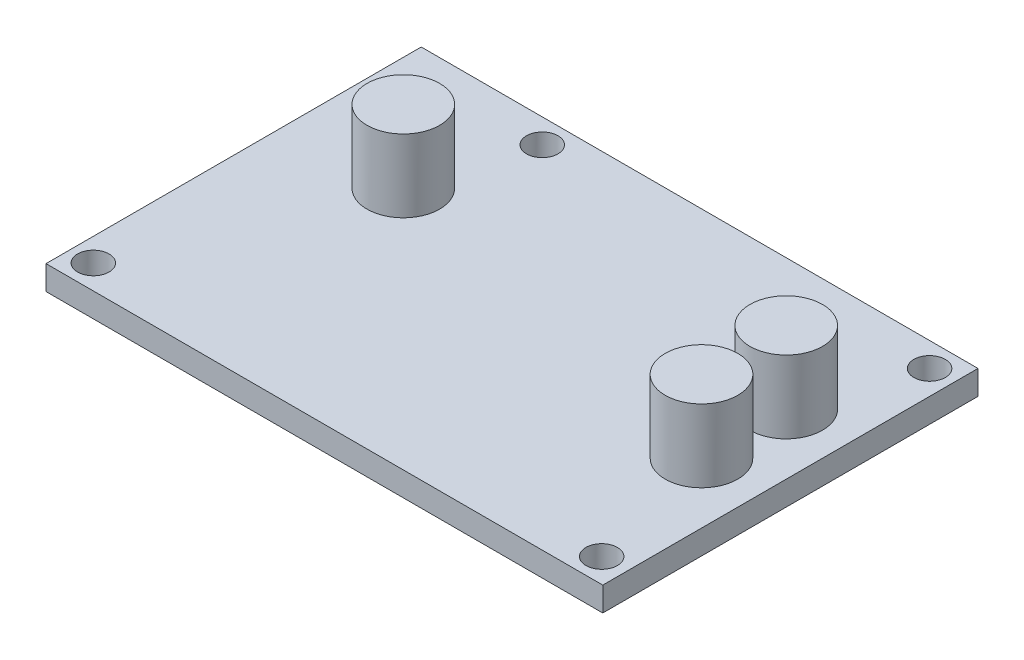
ISO-10303-21;
HEADER;
FILE_DESCRIPTION(('STEP AP214'),'2;1');
FILE_NAME('part.step','',(''),(''),'','','');
FILE_SCHEMA(('AUTOMOTIVE_DESIGN { 1 0 10303 214 1 1 1 1 }'));
ENDSEC;
DATA;
#1=APPLICATION_CONTEXT('core data for automotive mechanical design processes');
#2=APPLICATION_PROTOCOL_DEFINITION('international standard','automotive_design',2000,#1);
#3=PRODUCT_CONTEXT('',#1,'mechanical');
#4=PRODUCT('Part','Part','',(#3));
#5=PRODUCT_RELATED_PRODUCT_CATEGORY('part','',(#4));
#6=PRODUCT_DEFINITION_FORMATION('','',#4);
#7=PRODUCT_DEFINITION_CONTEXT('part definition',#1,'design');
#8=PRODUCT_DEFINITION('design','',#6,#7);
#9=PRODUCT_DEFINITION_SHAPE('','',#8);
#10=(LENGTH_UNIT() NAMED_UNIT(*) SI_UNIT(.MILLI.,.METRE.));
#11=(NAMED_UNIT(*) PLANE_ANGLE_UNIT() SI_UNIT($,.RADIAN.));
#12=(NAMED_UNIT(*) SI_UNIT($,.STERADIAN.) SOLID_ANGLE_UNIT());
#13=UNCERTAINTY_MEASURE_WITH_UNIT(LENGTH_MEASURE(1.E-05),#10,'distance_accuracy_value','');
#14=(GEOMETRIC_REPRESENTATION_CONTEXT(3) GLOBAL_UNCERTAINTY_ASSIGNED_CONTEXT((#13)) GLOBAL_UNIT_ASSIGNED_CONTEXT((#10,
#11,#12)) REPRESENTATION_CONTEXT('',''));
#15=CARTESIAN_POINT('',(0.,0.,0.));
#16=DIRECTION('',(0.,0.,1.));
#17=DIRECTION('',(1.,0.,0.));
#18=AXIS2_PLACEMENT_3D('',#15,#16,#17);
#19=CARTESIAN_POINT('',(0.,2.54,0.));
#20=DIRECTION('',(1.,0.,0.));
#21=DIRECTION('',(0.,0.,-1.));
#22=AXIS2_PLACEMENT_3D('',#19,#20,#21);
#23=PLANE('',#22);
#24=DIRECTION('',(0.,0.,1.));
#25=VECTOR('',#24,1.);
#26=CARTESIAN_POINT('',(0.,0.,0.));
#27=LINE('',#26,#25);
#28=CARTESIAN_POINT('',(0.,0.,-39.37));
#29=VERTEX_POINT('',#28);
#30=CARTESIAN_POINT('',(0.,0.,0.));
#31=VERTEX_POINT('',#30);
#32=EDGE_CURVE('E101',#29,#31,#27,.T.);
#33=ORIENTED_EDGE('',*,*,#32,.T.);
#34=DIRECTION('',(0.,-1.,0.));
#35=VECTOR('',#34,1.);
#36=CARTESIAN_POINT('',(0.,2.54,0.));
#37=LINE('',#36,#35);
#38=CARTESIAN_POINT('',(0.,2.54,0.));
#39=VERTEX_POINT('',#38);
#40=EDGE_CURVE('E92',#39,#31,#37,.T.);
#41=ORIENTED_EDGE('',*,*,#40,.F.);
#42=DIRECTION('',(0.,0.,1.));
#43=VECTOR('',#42,1.);
#44=CARTESIAN_POINT('',(0.,2.54,0.));
#45=LINE('',#44,#43);
#46=CARTESIAN_POINT('',(0.,2.54,-39.37));
#47=VERTEX_POINT('',#46);
#48=EDGE_CURVE('E86',#47,#39,#45,.T.);
#49=ORIENTED_EDGE('',*,*,#48,.F.);
#50=DIRECTION('',(0.,-1.,0.));
#51=VECTOR('',#50,1.);
#52=CARTESIAN_POINT('',(0.,2.54,-39.37));
#53=LINE('',#52,#51);
#54=EDGE_CURVE('E97',#47,#29,#53,.T.);
#55=ORIENTED_EDGE('',*,*,#54,.T.);
#56=EDGE_LOOP('',(#33,#41,#49,#55));
#57=FACE_BOUND('',#56,.T.);
#58=ADVANCED_FACE('F34',(#57),#23,.F.);
#59=CARTESIAN_POINT('',(0.,2.54,0.));
#60=DIRECTION('',(0.,0.,-1.));
#61=DIRECTION('',(-1.,0.,0.));
#62=AXIS2_PLACEMENT_3D('',#59,#60,#61);
#63=PLANE('',#62);
#64=DIRECTION('',(1.,0.,0.));
#65=VECTOR('',#64,1.);
#66=CARTESIAN_POINT('',(0.,0.,0.));
#67=LINE('',#66,#65);
#68=CARTESIAN_POINT('',(58.42,0.,0.));
#69=VERTEX_POINT('',#68);
#70=EDGE_CURVE('E91',#31,#69,#67,.T.);
#71=ORIENTED_EDGE('',*,*,#70,.T.);
#72=DIRECTION('',(0.,-1.,0.));
#73=VECTOR('',#72,1.);
#74=CARTESIAN_POINT('',(58.42,2.54,0.));
#75=LINE('',#74,#73);
#76=CARTESIAN_POINT('',(58.42,2.54,0.));
#77=VERTEX_POINT('',#76);
#78=EDGE_CURVE('E89',#77,#69,#75,.T.);
#79=ORIENTED_EDGE('',*,*,#78,.F.);
#80=DIRECTION('',(1.,0.,0.));
#81=VECTOR('',#80,1.);
#82=CARTESIAN_POINT('',(0.,2.54,0.));
#83=LINE('',#82,#81);
#84=EDGE_CURVE('E81',#39,#77,#83,.T.);
#85=ORIENTED_EDGE('',*,*,#84,.F.);
#86=ORIENTED_EDGE('',*,*,#40,.T.);
#87=EDGE_LOOP('',(#71,#79,#85,#86));
#88=FACE_BOUND('',#87,.T.);
#89=ADVANCED_FACE('F90',(#88),#63,.F.);
#90=CARTESIAN_POINT('',(58.42,2.54,0.));
#91=DIRECTION('',(-1.,0.,0.));
#92=DIRECTION('',(0.,0.,1.));
#93=AXIS2_PLACEMENT_3D('',#90,#91,#92);
#94=PLANE('',#93);
#95=DIRECTION('',(0.,0.,-1.));
#96=VECTOR('',#95,1.);
#97=CARTESIAN_POINT('',(58.42,0.,0.));
#98=LINE('',#97,#96);
#99=CARTESIAN_POINT('',(58.42,0.,-39.37));
#100=VERTEX_POINT('',#99);
#101=EDGE_CURVE('E67',#69,#100,#98,.T.);
#102=ORIENTED_EDGE('',*,*,#101,.T.);
#103=DIRECTION('',(0.,-1.,0.));
#104=VECTOR('',#103,1.);
#105=CARTESIAN_POINT('',(58.42,2.54,-39.37));
#106=LINE('',#105,#104);
#107=CARTESIAN_POINT('',(58.42,2.54,-39.37));
#108=VERTEX_POINT('',#107);
#109=EDGE_CURVE('E93',#108,#100,#106,.T.);
#110=ORIENTED_EDGE('',*,*,#109,.F.);
#111=DIRECTION('',(0.,0.,-1.));
#112=VECTOR('',#111,1.);
#113=CARTESIAN_POINT('',(58.42,2.54,0.));
#114=LINE('',#113,#112);
#115=EDGE_CURVE('E84',#77,#108,#114,.T.);
#116=ORIENTED_EDGE('',*,*,#115,.F.);
#117=ORIENTED_EDGE('',*,*,#78,.T.);
#118=EDGE_LOOP('',(#102,#110,#116,#117));
#119=FACE_BOUND('',#118,.T.);
#120=ADVANCED_FACE('F95',(#119),#94,.F.);
#121=CARTESIAN_POINT('',(0.,2.54,-39.37));
#122=DIRECTION('',(0.,0.,1.));
#123=DIRECTION('',(1.,0.,0.));
#124=AXIS2_PLACEMENT_3D('',#121,#122,#123);
#125=PLANE('',#124);
#126=DIRECTION('',(-1.,0.,0.));
#127=VECTOR('',#126,1.);
#128=CARTESIAN_POINT('',(0.,0.,-39.37));
#129=LINE('',#128,#127);
#130=EDGE_CURVE('E73',#100,#29,#129,.T.);
#131=ORIENTED_EDGE('',*,*,#130,.T.);
#132=ORIENTED_EDGE('',*,*,#54,.F.);
#133=DIRECTION('',(-1.,0.,0.));
#134=VECTOR('',#133,1.);
#135=CARTESIAN_POINT('',(0.,2.54,-39.37));
#136=LINE('',#135,#134);
#137=EDGE_CURVE('E50',#108,#47,#136,.T.);
#138=ORIENTED_EDGE('',*,*,#137,.F.);
#139=ORIENTED_EDGE('',*,*,#109,.T.);
#140=EDGE_LOOP('',(#131,#132,#138,#139));
#141=FACE_BOUND('',#140,.T.);
#142=ADVANCED_FACE('F121',(#141),#125,.F.);
#143=CARTESIAN_POINT('',(0.,2.54,0.));
#144=DIRECTION('',(0.,-1.,0.));
#145=DIRECTION('',(0.,0.,-1.));
#146=AXIS2_PLACEMENT_3D('',#143,#144,#145);
#147=PLANE('',#146);
#148=CARTESIAN_POINT('',(11.8950137782008,2.54,-25.5978687199957));
#149=DIRECTION('',(0.,-1.,0.));
#150=DIRECTION('',(0.,0.,-1.));
#151=AXIS2_PLACEMENT_3D('',#148,#149,#150);
#152=CIRCLE('',#151,3.81);
#153=CARTESIAN_POINT('',(11.8950137782008,2.54,-29.4078687199957));
#154=VERTEX_POINT('',#153);
#155=EDGE_CURVE('E11',#154,#154,#152,.F.);
#156=ORIENTED_EDGE('',*,*,#155,.F.);
#157=EDGE_LOOP('',(#156));
#158=FACE_BOUND('',#157,.T.);
#159=CARTESIAN_POINT('',(52.07,2.54,-16.7078687199957));
#160=DIRECTION('',(0.,-1.,0.));
#161=DIRECTION('',(0.,0.,-1.));
#162=AXIS2_PLACEMENT_3D('',#159,#160,#161);
#163=CIRCLE('',#162,3.81);
#164=CARTESIAN_POINT('',(52.07,2.54,-20.5178687199957));
#165=VERTEX_POINT('',#164);
#166=EDGE_CURVE('E42',#165,#165,#163,.F.);
#167=ORIENTED_EDGE('',*,*,#166,.F.);
#168=EDGE_LOOP('',(#167));
#169=FACE_BOUND('',#168,.T.);
#170=CARTESIAN_POINT('',(52.07,2.54,-25.5978687199957));
#171=DIRECTION('',(0.,-1.,0.));
#172=DIRECTION('',(0.,0.,-1.));
#173=AXIS2_PLACEMENT_3D('',#170,#171,#172);
#174=CIRCLE('',#173,3.81);
#175=CARTESIAN_POINT('',(52.07,2.54,-29.4078687199957));
#176=VERTEX_POINT('',#175);
#177=EDGE_CURVE('E111',#176,#176,#174,.F.);
#178=ORIENTED_EDGE('',*,*,#177,.F.);
#179=EDGE_LOOP('',(#178));
#180=FACE_BOUND('',#179,.T.);
#181=CARTESIAN_POINT('',(55.7647094,2.54,-2.54));
#182=DIRECTION('',(0.,1.,0.));
#183=DIRECTION('',(0.,0.,1.));
#184=AXIS2_PLACEMENT_3D('',#181,#182,#183);
#185=CIRCLE('',#184,1.651);
#186=CARTESIAN_POINT('',(55.7647094,2.54,-0.889000000000001));
#187=VERTEX_POINT('',#186);
#188=EDGE_CURVE('E129',#187,#187,#185,.T.);
#189=ORIENTED_EDGE('',*,*,#188,.F.);
#190=EDGE_LOOP('',(#189));
#191=FACE_BOUND('',#190,.T.);
#192=CARTESIAN_POINT('',(15.240000000462,2.54,-36.83));
#193=DIRECTION('',(0.,1.,0.));
#194=DIRECTION('',(0.,0.,1.));
#195=AXIS2_PLACEMENT_3D('',#192,#193,#194);
#196=CIRCLE('',#195,1.651);
#197=CARTESIAN_POINT('',(15.240000000462,2.54,-35.179));
#198=VERTEX_POINT('',#197);
#199=EDGE_CURVE('E133',#198,#198,#196,.T.);
#200=ORIENTED_EDGE('',*,*,#199,.F.);
#201=EDGE_LOOP('',(#200));
#202=FACE_BOUND('',#201,.T.);
#203=CARTESIAN_POINT('',(55.88,2.54,-36.8298061831436));
#204=DIRECTION('',(0.,1.,0.));
#205=DIRECTION('',(0.,0.,1.));
#206=AXIS2_PLACEMENT_3D('',#203,#204,#205);
#207=CIRCLE('',#206,1.65100000758999);
#208=CARTESIAN_POINT('',(55.88,2.54,-35.1788061755536));
#209=VERTEX_POINT('',#208);
#210=EDGE_CURVE('E137',#209,#209,#207,.T.);
#211=ORIENTED_EDGE('',*,*,#210,.F.);
#212=EDGE_LOOP('',(#211));
#213=FACE_BOUND('',#212,.T.);
#214=CARTESIAN_POINT('',(2.4247094,2.54,-2.54));
#215=DIRECTION('',(0.,1.,0.));
#216=DIRECTION('',(0.,0.,1.));
#217=AXIS2_PLACEMENT_3D('',#214,#215,#216);
#218=CIRCLE('',#217,1.651);
#219=CARTESIAN_POINT('',(2.4247094,2.54,-0.889));
#220=VERTEX_POINT('',#219);
#221=EDGE_CURVE('E104',#220,#220,#218,.T.);
#222=ORIENTED_EDGE('',*,*,#221,.F.);
#223=EDGE_LOOP('',(#222));
#224=FACE_BOUND('',#223,.T.);
#225=ORIENTED_EDGE('',*,*,#48,.T.);
#226=ORIENTED_EDGE('',*,*,#84,.T.);
#227=ORIENTED_EDGE('',*,*,#115,.T.);
#228=ORIENTED_EDGE('',*,*,#137,.T.);
#229=EDGE_LOOP('',(#225,#226,#227,#228));
#230=FACE_BOUND('',#229,.T.);
#231=ADVANCED_FACE('F82',(#158,#169,#180,#191,#202,#213,#224,#230),#147,.F.);
#232=CARTESIAN_POINT('',(0.,0.,0.));
#233=DIRECTION('',(0.,-1.,0.));
#234=DIRECTION('',(0.,0.,-1.));
#235=AXIS2_PLACEMENT_3D('',#232,#233,#234);
#236=PLANE('',#235);
#237=CARTESIAN_POINT('',(55.7647094,0.,-2.54));
#238=DIRECTION('',(0.,-1.,0.));
#239=DIRECTION('',(0.,0.,-1.));
#240=AXIS2_PLACEMENT_3D('',#237,#238,#239);
#241=CIRCLE('',#240,1.651);
#242=CARTESIAN_POINT('',(55.7647094,0.,-4.191));
#243=VERTEX_POINT('',#242);
#244=EDGE_CURVE('E155',#243,#243,#241,.F.);
#245=ORIENTED_EDGE('',*,*,#244,.T.);
#246=EDGE_LOOP('',(#245));
#247=FACE_BOUND('',#246,.T.);
#248=CARTESIAN_POINT('',(15.240000000462,0.,-36.83));
#249=DIRECTION('',(0.,-1.,0.));
#250=DIRECTION('',(0.,0.,-1.));
#251=AXIS2_PLACEMENT_3D('',#248,#249,#250);
#252=CIRCLE('',#251,1.651);
#253=CARTESIAN_POINT('',(15.240000000462,0.,-38.481));
#254=VERTEX_POINT('',#253);
#255=EDGE_CURVE('E151',#254,#254,#252,.F.);
#256=ORIENTED_EDGE('',*,*,#255,.T.);
#257=EDGE_LOOP('',(#256));
#258=FACE_BOUND('',#257,.T.);
#259=CARTESIAN_POINT('',(55.88,0.,-36.8298061831436));
#260=DIRECTION('',(0.,-1.,0.));
#261=DIRECTION('',(0.,0.,-1.));
#262=AXIS2_PLACEMENT_3D('',#259,#260,#261);
#263=CIRCLE('',#262,1.65100000758999);
#264=CARTESIAN_POINT('',(55.88,0.,-38.4808061907336));
#265=VERTEX_POINT('',#264);
#266=EDGE_CURVE('E146',#265,#265,#263,.F.);
#267=ORIENTED_EDGE('',*,*,#266,.T.);
#268=EDGE_LOOP('',(#267));
#269=FACE_BOUND('',#268,.T.);
#270=CARTESIAN_POINT('',(2.4247094,0.,-2.54));
#271=DIRECTION('',(0.,-1.,0.));
#272=DIRECTION('',(0.,0.,-1.));
#273=AXIS2_PLACEMENT_3D('',#270,#271,#272);
#274=CIRCLE('',#273,1.651);
#275=CARTESIAN_POINT('',(2.4247094,0.,-4.191));
#276=VERTEX_POINT('',#275);
#277=EDGE_CURVE('E141',#276,#276,#274,.F.);
#278=ORIENTED_EDGE('',*,*,#277,.T.);
#279=EDGE_LOOP('',(#278));
#280=FACE_BOUND('',#279,.T.);
#281=ORIENTED_EDGE('',*,*,#32,.F.);
#282=ORIENTED_EDGE('',*,*,#130,.F.);
#283=ORIENTED_EDGE('',*,*,#101,.F.);
#284=ORIENTED_EDGE('',*,*,#70,.F.);
#285=EDGE_LOOP('',(#281,#282,#283,#284));
#286=FACE_BOUND('',#285,.T.);
#287=ADVANCED_FACE('F120',(#247,#258,#269,#280,#286),#236,.T.);
#288=CARTESIAN_POINT('',(2.4247094,-0.00100000000000013,-2.54));
#289=DIRECTION('',(0.,1.,0.));
#290=DIRECTION('',(0.,0.,1.));
#291=AXIS2_PLACEMENT_3D('',#288,#289,#290);
#292=CYLINDRICAL_SURFACE('',#291,1.651);
#293=ORIENTED_EDGE('',*,*,#277,.F.);
#294=EDGE_LOOP('',(#293));
#295=FACE_BOUND('',#294,.T.);
#296=ORIENTED_EDGE('',*,*,#221,.T.);
#297=EDGE_LOOP('',(#296));
#298=FACE_BOUND('',#297,.T.);
#299=ADVANCED_FACE('F191',(#295,#298),#292,.F.);
#300=CARTESIAN_POINT('',(55.88,-0.00100000000000013,-36.8298061831436));
#301=DIRECTION('',(0.,1.,0.));
#302=DIRECTION('',(0.,0.,1.));
#303=AXIS2_PLACEMENT_3D('',#300,#301,#302);
#304=CYLINDRICAL_SURFACE('',#303,1.65100000758999);
#305=ORIENTED_EDGE('',*,*,#266,.F.);
#306=EDGE_LOOP('',(#305));
#307=FACE_BOUND('',#306,.T.);
#308=ORIENTED_EDGE('',*,*,#210,.T.);
#309=EDGE_LOOP('',(#308));
#310=FACE_BOUND('',#309,.T.);
#311=ADVANCED_FACE('F197',(#307,#310),#304,.F.);
#312=CARTESIAN_POINT('',(15.240000000462,-0.00100000000000013,-36.83));
#313=DIRECTION('',(0.,1.,0.));
#314=DIRECTION('',(0.,0.,1.));
#315=AXIS2_PLACEMENT_3D('',#312,#313,#314);
#316=CYLINDRICAL_SURFACE('',#315,1.651);
#317=ORIENTED_EDGE('',*,*,#255,.F.);
#318=EDGE_LOOP('',(#317));
#319=FACE_BOUND('',#318,.T.);
#320=ORIENTED_EDGE('',*,*,#199,.T.);
#321=EDGE_LOOP('',(#320));
#322=FACE_BOUND('',#321,.T.);
#323=ADVANCED_FACE('F278',(#319,#322),#316,.F.);
#324=CARTESIAN_POINT('',(55.7647094,-0.00100000000000013,-2.54));
#325=DIRECTION('',(0.,1.,0.));
#326=DIRECTION('',(0.,0.,1.));
#327=AXIS2_PLACEMENT_3D('',#324,#325,#326);
#328=CYLINDRICAL_SURFACE('',#327,1.651);
#329=ORIENTED_EDGE('',*,*,#244,.F.);
#330=EDGE_LOOP('',(#329));
#331=FACE_BOUND('',#330,.T.);
#332=ORIENTED_EDGE('',*,*,#188,.T.);
#333=EDGE_LOOP('',(#332));
#334=FACE_BOUND('',#333,.T.);
#335=ADVANCED_FACE('F226',(#331,#334),#328,.F.);
#336=CARTESIAN_POINT('',(52.07,10.16,-25.5978687199957));
#337=DIRECTION('',(0.,-1.,0.));
#338=DIRECTION('',(0.,0.,-1.));
#339=AXIS2_PLACEMENT_3D('',#336,#337,#338);
#340=CYLINDRICAL_SURFACE('',#339,3.81);
#341=CARTESIAN_POINT('',(52.07,10.16,-25.5978687199957));
#342=DIRECTION('',(0.,1.,0.));
#343=DIRECTION('',(0.,0.,1.));
#344=AXIS2_PLACEMENT_3D('',#341,#342,#343);
#345=CIRCLE('',#344,3.81);
#346=CARTESIAN_POINT('',(52.07,10.16,-21.7878687199957));
#347=VERTEX_POINT('',#346);
#348=EDGE_CURVE('E149',#347,#347,#345,.T.);
#349=ORIENTED_EDGE('',*,*,#348,.F.);
#350=EDGE_LOOP('',(#349));
#351=FACE_BOUND('',#350,.T.);
#352=ORIENTED_EDGE('',*,*,#177,.T.);
#353=EDGE_LOOP('',(#352));
#354=FACE_BOUND('',#353,.T.);
#355=ADVANCED_FACE('F231',(#351,#354),#340,.T.);
#356=CARTESIAN_POINT('',(52.07,10.16,-25.5978687199957));
#357=DIRECTION('',(0.,1.,0.));
#358=DIRECTION('',(0.,0.,1.));
#359=AXIS2_PLACEMENT_3D('',#356,#357,#358);
#360=PLANE('',#359);
#361=ORIENTED_EDGE('',*,*,#348,.T.);
#362=EDGE_LOOP('',(#361));
#363=FACE_BOUND('',#362,.T.);
#364=ADVANCED_FACE('F236',(#363),#360,.T.);
#365=CARTESIAN_POINT('',(52.07,10.16,-16.7078687199957));
#366=DIRECTION('',(0.,-1.,0.));
#367=DIRECTION('',(0.,0.,-1.));
#368=AXIS2_PLACEMENT_3D('',#365,#366,#367);
#369=CYLINDRICAL_SURFACE('',#368,3.81);
#370=CARTESIAN_POINT('',(52.07,10.16,-16.7078687199957));
#371=DIRECTION('',(0.,1.,0.));
#372=DIRECTION('',(0.,0.,1.));
#373=AXIS2_PLACEMENT_3D('',#370,#371,#372);
#374=CIRCLE('',#373,3.81);
#375=CARTESIAN_POINT('',(52.07,10.16,-12.8978687199957));
#376=VERTEX_POINT('',#375);
#377=EDGE_CURVE('E161',#376,#376,#374,.T.);
#378=ORIENTED_EDGE('',*,*,#377,.F.);
#379=EDGE_LOOP('',(#378));
#380=FACE_BOUND('',#379,.T.);
#381=ORIENTED_EDGE('',*,*,#166,.T.);
#382=EDGE_LOOP('',(#381));
#383=FACE_BOUND('',#382,.T.);
#384=ADVANCED_FACE('F116',(#380,#383),#369,.T.);
#385=CARTESIAN_POINT('',(52.07,10.16,-16.7078687199957));
#386=DIRECTION('',(0.,1.,0.));
#387=DIRECTION('',(0.,0.,1.));
#388=AXIS2_PLACEMENT_3D('',#385,#386,#387);
#389=PLANE('',#388);
#390=ORIENTED_EDGE('',*,*,#377,.T.);
#391=EDGE_LOOP('',(#390));
#392=FACE_BOUND('',#391,.T.);
#393=ADVANCED_FACE('F173',(#392),#389,.T.);
#394=CARTESIAN_POINT('',(11.8950137782008,10.16,-25.5978687199957));
#395=DIRECTION('',(0.,-1.,0.));
#396=DIRECTION('',(0.,0.,-1.));
#397=AXIS2_PLACEMENT_3D('',#394,#395,#396);
#398=CYLINDRICAL_SURFACE('',#397,3.81);
#399=CARTESIAN_POINT('',(11.8950137782008,10.16,-25.5978687199957));
#400=DIRECTION('',(0.,1.,0.));
#401=DIRECTION('',(0.,0.,1.));
#402=AXIS2_PLACEMENT_3D('',#399,#400,#401);
#403=CIRCLE('',#402,3.81);
#404=CARTESIAN_POINT('',(11.8950137782008,10.16,-21.7878687199957));
#405=VERTEX_POINT('',#404);
#406=EDGE_CURVE('E164',#405,#405,#403,.T.);
#407=ORIENTED_EDGE('',*,*,#406,.F.);
#408=EDGE_LOOP('',(#407));
#409=FACE_BOUND('',#408,.T.);
#410=ORIENTED_EDGE('',*,*,#155,.T.);
#411=EDGE_LOOP('',(#410));
#412=FACE_BOUND('',#411,.T.);
#413=ADVANCED_FACE('F170',(#409,#412),#398,.T.);
#414=CARTESIAN_POINT('',(11.8950137782008,10.16,-25.5978687199957));
#415=DIRECTION('',(0.,1.,0.));
#416=DIRECTION('',(0.,0.,1.));
#417=AXIS2_PLACEMENT_3D('',#414,#415,#416);
#418=PLANE('',#417);
#419=ORIENTED_EDGE('',*,*,#406,.T.);
#420=EDGE_LOOP('',(#419));
#421=FACE_BOUND('',#420,.T.);
#422=ADVANCED_FACE('F168',(#421),#418,.T.);
#423=CLOSED_SHELL('',(#58,#89,#120,#142,#231,#287,#299,#311,#323,#335,#355,#364,#384,#393,#413,#422));
#424=MANIFOLD_SOLID_BREP('B2',#423);
#425=ADVANCED_BREP_SHAPE_REPRESENTATION('',(#18,#424),#14);
#426=SHAPE_DEFINITION_REPRESENTATION(#9,#425);
ENDSEC;
END-ISO-10303-21;
